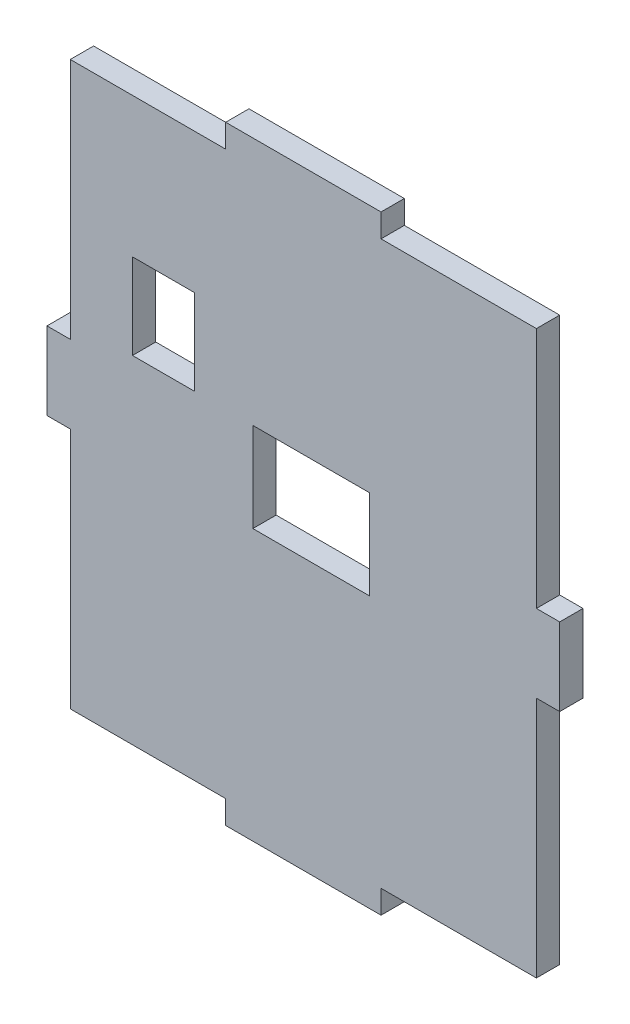
ISO-10303-21;
HEADER;
FILE_DESCRIPTION(('STEP AP214'),'2;1');
FILE_NAME('part.step','',(''),(''),'','','');
FILE_SCHEMA(('AUTOMOTIVE_DESIGN { 1 0 10303 214 1 1 1 1 }'));
ENDSEC;
DATA;
#1=APPLICATION_CONTEXT('core data for automotive mechanical design processes');
#2=APPLICATION_PROTOCOL_DEFINITION('international standard','automotive_design',2000,#1);
#3=PRODUCT_CONTEXT('',#1,'mechanical');
#4=PRODUCT('Part','Part','',(#3));
#5=PRODUCT_RELATED_PRODUCT_CATEGORY('part','',(#4));
#6=PRODUCT_DEFINITION_FORMATION('','',#4);
#7=PRODUCT_DEFINITION_CONTEXT('part definition',#1,'design');
#8=PRODUCT_DEFINITION('design','',#6,#7);
#9=PRODUCT_DEFINITION_SHAPE('','',#8);
#10=(LENGTH_UNIT() NAMED_UNIT(*) SI_UNIT(.MILLI.,.METRE.));
#11=(NAMED_UNIT(*) PLANE_ANGLE_UNIT() SI_UNIT($,.RADIAN.));
#12=(NAMED_UNIT(*) SI_UNIT($,.STERADIAN.) SOLID_ANGLE_UNIT());
#13=UNCERTAINTY_MEASURE_WITH_UNIT(LENGTH_MEASURE(1.E-05),#10,'distance_accuracy_value','');
#14=(GEOMETRIC_REPRESENTATION_CONTEXT(3) GLOBAL_UNCERTAINTY_ASSIGNED_CONTEXT((#13)) GLOBAL_UNIT_ASSIGNED_CONTEXT((#10,
#11,#12)) REPRESENTATION_CONTEXT('',''));
#15=CARTESIAN_POINT('',(0.,0.,0.));
#16=DIRECTION('',(0.,0.,1.));
#17=DIRECTION('',(1.,0.,0.));
#18=AXIS2_PLACEMENT_3D('',#15,#16,#17);
#19=CARTESIAN_POINT('',(0.,0.,3.));
#20=DIRECTION('',(0.,0.,1.));
#21=DIRECTION('',(1.,0.,0.));
#22=AXIS2_PLACEMENT_3D('',#19,#20,#21);
#23=PLANE('',#22);
#24=DIRECTION('',(-1.,0.,0.));
#25=VECTOR('',#24,1.);
#26=CARTESIAN_POINT('',(-47.6817994759,-34.0455415681,3.));
#27=LINE('',#26,#25);
#28=CARTESIAN_POINT('',(-47.6817994759,-34.0455415681,3.));
#29=VERTEX_POINT('',#28);
#30=CARTESIAN_POINT('',(-62.6817994759,-34.0455415681,3.));
#31=VERTEX_POINT('',#30);
#32=EDGE_CURVE('E399',#29,#31,#27,.T.);
#33=ORIENTED_EDGE('',*,*,#32,.F.);
#34=DIRECTION('',(0.,1.,0.));
#35=VECTOR('',#34,1.);
#36=CARTESIAN_POINT('',(-47.6817994759,-45.5455415681,3.));
#37=LINE('',#36,#35);
#38=CARTESIAN_POINT('',(-47.6817994759,-45.5455415681,3.));
#39=VERTEX_POINT('',#38);
#40=EDGE_CURVE('E397',#39,#29,#37,.T.);
#41=ORIENTED_EDGE('',*,*,#40,.F.);
#42=DIRECTION('',(1.,0.,0.));
#43=VECTOR('',#42,1.);
#44=CARTESIAN_POINT('',(-62.6817994759,-45.5455415681,3.));
#45=LINE('',#44,#43);
#46=CARTESIAN_POINT('',(-62.6817994759,-45.5455415681,3.));
#47=VERTEX_POINT('',#46);
#48=EDGE_CURVE('E405',#47,#39,#45,.T.);
#49=ORIENTED_EDGE('',*,*,#48,.F.);
#50=DIRECTION('',(0.,-1.,0.));
#51=VECTOR('',#50,1.);
#52=CARTESIAN_POINT('',(-62.6817994759,-34.0455415681,3.));
#53=LINE('',#52,#51);
#54=EDGE_CURVE('E402',#31,#47,#53,.T.);
#55=ORIENTED_EDGE('',*,*,#54,.F.);
#56=EDGE_LOOP('',(#33,#41,#49,#55));
#57=FACE_BOUND('',#56,.T.);
#58=DIRECTION('',(-1.,0.,0.));
#59=VECTOR('',#58,1.);
#60=CARTESIAN_POINT('',(-66.1817994759,-5.,3.));
#61=LINE('',#60,#59);
#62=CARTESIAN_POINT('',(-66.1817994759,-5.,3.));
#63=VERTEX_POINT('',#62);
#64=CARTESIAN_POINT('',(-86.1817994759,-5.,3.));
#65=VERTEX_POINT('',#64);
#66=EDGE_CURVE('E428',#63,#65,#61,.T.);
#67=ORIENTED_EDGE('',*,*,#66,.T.);
#68=DIRECTION('',(0.,-1.,0.));
#69=VECTOR('',#68,1.);
#70=CARTESIAN_POINT('',(-86.1817994759,-5.,3.));
#71=LINE('',#70,#69);
#72=CARTESIAN_POINT('',(-86.1817994759,-36.2,3.));
#73=VERTEX_POINT('',#72);
#74=EDGE_CURVE('E431',#65,#73,#71,.T.);
#75=ORIENTED_EDGE('',*,*,#74,.T.);
#76=DIRECTION('',(-1.,0.,0.));
#77=VECTOR('',#76,1.);
#78=CARTESIAN_POINT('',(-86.1817994759,-36.2,3.));
#79=LINE('',#78,#77);
#80=CARTESIAN_POINT('',(-89.1817994759,-36.2,3.));
#81=VERTEX_POINT('',#80);
#82=EDGE_CURVE('E434',#73,#81,#79,.T.);
#83=ORIENTED_EDGE('',*,*,#82,.T.);
#84=DIRECTION('',(0.,-1.,0.));
#85=VECTOR('',#84,1.);
#86=CARTESIAN_POINT('',(-89.1817994759,-36.2,3.));
#87=LINE('',#86,#85);
#88=CARTESIAN_POINT('',(-89.1817994759,-46.2,3.));
#89=VERTEX_POINT('',#88);
#90=EDGE_CURVE('E436',#81,#89,#87,.T.);
#91=ORIENTED_EDGE('',*,*,#90,.T.);
#92=DIRECTION('',(1.,0.,0.));
#93=VECTOR('',#92,1.);
#94=CARTESIAN_POINT('',(-89.1817994759,-46.2,3.));
#95=LINE('',#94,#93);
#96=CARTESIAN_POINT('',(-86.1817994759,-46.2,3.));
#97=VERTEX_POINT('',#96);
#98=EDGE_CURVE('E438',#89,#97,#95,.T.);
#99=ORIENTED_EDGE('',*,*,#98,.T.);
#100=DIRECTION('',(0.,-1.,0.));
#101=VECTOR('',#100,1.);
#102=CARTESIAN_POINT('',(-86.1817994759,-46.2,3.));
#103=LINE('',#102,#101);
#104=CARTESIAN_POINT('',(-86.1817994759,-77.4000000000001,3.));
#105=VERTEX_POINT('',#104);
#106=EDGE_CURVE('E440',#97,#105,#103,.T.);
#107=ORIENTED_EDGE('',*,*,#106,.T.);
#108=DIRECTION('',(1.,0.,0.));
#109=VECTOR('',#108,1.);
#110=CARTESIAN_POINT('',(-86.1817994759,-77.4000000000001,3.));
#111=LINE('',#110,#109);
#112=CARTESIAN_POINT('',(-66.1817994759,-77.4000000000001,3.));
#113=VERTEX_POINT('',#112);
#114=EDGE_CURVE('E442',#105,#113,#111,.T.);
#115=ORIENTED_EDGE('',*,*,#114,.T.);
#116=DIRECTION('',(0.,-1.,0.));
#117=VECTOR('',#116,1.);
#118=CARTESIAN_POINT('',(-66.1817994759,-77.4000000000001,3.));
#119=LINE('',#118,#117);
#120=CARTESIAN_POINT('',(-66.1817994759,-80.4,3.));
#121=VERTEX_POINT('',#120);
#122=EDGE_CURVE('E444',#113,#121,#119,.T.);
#123=ORIENTED_EDGE('',*,*,#122,.T.);
#124=DIRECTION('',(1.,0.,0.));
#125=VECTOR('',#124,1.);
#126=CARTESIAN_POINT('',(-66.1817994759,-80.4,3.));
#127=LINE('',#126,#125);
#128=CARTESIAN_POINT('',(-46.1817994759,-80.4,3.));
#129=VERTEX_POINT('',#128);
#130=EDGE_CURVE('E446',#121,#129,#127,.T.);
#131=ORIENTED_EDGE('',*,*,#130,.T.);
#132=DIRECTION('',(0.,1.,0.));
#133=VECTOR('',#132,1.);
#134=CARTESIAN_POINT('',(-46.1817994759,-80.4,3.));
#135=LINE('',#134,#133);
#136=CARTESIAN_POINT('',(-46.1817994759,-77.4,3.));
#137=VERTEX_POINT('',#136);
#138=EDGE_CURVE('E448',#129,#137,#135,.T.);
#139=ORIENTED_EDGE('',*,*,#138,.T.);
#140=DIRECTION('',(1.,0.,0.));
#141=VECTOR('',#140,1.);
#142=CARTESIAN_POINT('',(-46.1817994759,-77.4,3.));
#143=LINE('',#142,#141);
#144=CARTESIAN_POINT('',(-26.1817994759,-77.4,3.));
#145=VERTEX_POINT('',#144);
#146=EDGE_CURVE('E450',#137,#145,#143,.T.);
#147=ORIENTED_EDGE('',*,*,#146,.T.);
#148=DIRECTION('',(0.,1.,0.));
#149=VECTOR('',#148,1.);
#150=CARTESIAN_POINT('',(-26.1817994759,-77.4,3.));
#151=LINE('',#150,#149);
#152=CARTESIAN_POINT('',(-26.1817994759,-46.2,3.));
#153=VERTEX_POINT('',#152);
#154=EDGE_CURVE('E452',#145,#153,#151,.T.);
#155=ORIENTED_EDGE('',*,*,#154,.T.);
#156=DIRECTION('',(1.,0.,0.));
#157=VECTOR('',#156,1.);
#158=CARTESIAN_POINT('',(-26.1817994759,-46.2,3.));
#159=LINE('',#158,#157);
#160=CARTESIAN_POINT('',(-23.1817994759,-46.2,3.));
#161=VERTEX_POINT('',#160);
#162=EDGE_CURVE('E454',#153,#161,#159,.T.);
#163=ORIENTED_EDGE('',*,*,#162,.T.);
#164=DIRECTION('',(0.,1.,0.));
#165=VECTOR('',#164,1.);
#166=CARTESIAN_POINT('',(-23.1817994759,-46.2,3.));
#167=LINE('',#166,#165);
#168=CARTESIAN_POINT('',(-23.1817994759,-36.2,3.));
#169=VERTEX_POINT('',#168);
#170=EDGE_CURVE('E456',#161,#169,#167,.T.);
#171=ORIENTED_EDGE('',*,*,#170,.T.);
#172=DIRECTION('',(-1.,0.,0.));
#173=VECTOR('',#172,1.);
#174=CARTESIAN_POINT('',(-23.1817994759,-36.2,3.));
#175=LINE('',#174,#173);
#176=CARTESIAN_POINT('',(-26.1817994759,-36.2,3.));
#177=VERTEX_POINT('',#176);
#178=EDGE_CURVE('E458',#169,#177,#175,.T.);
#179=ORIENTED_EDGE('',*,*,#178,.T.);
#180=DIRECTION('',(0.,1.,0.));
#181=VECTOR('',#180,1.);
#182=CARTESIAN_POINT('',(-26.1817994759,-36.2,3.));
#183=LINE('',#182,#181);
#184=CARTESIAN_POINT('',(-26.1817994759,-5.,3.));
#185=VERTEX_POINT('',#184);
#186=EDGE_CURVE('E460',#177,#185,#183,.T.);
#187=ORIENTED_EDGE('',*,*,#186,.T.);
#188=DIRECTION('',(-1.,0.,0.));
#189=VECTOR('',#188,1.);
#190=CARTESIAN_POINT('',(-26.1817994759,-5.,3.));
#191=LINE('',#190,#189);
#192=CARTESIAN_POINT('',(-46.1817994759,-5.,3.));
#193=VERTEX_POINT('',#192);
#194=EDGE_CURVE('E462',#185,#193,#191,.T.);
#195=ORIENTED_EDGE('',*,*,#194,.T.);
#196=DIRECTION('',(0.,1.,0.));
#197=VECTOR('',#196,1.);
#198=CARTESIAN_POINT('',(-46.1817994759,-5.,3.));
#199=LINE('',#198,#197);
#200=CARTESIAN_POINT('',(-46.1817994759,-2.,3.));
#201=VERTEX_POINT('',#200);
#202=EDGE_CURVE('E464',#193,#201,#199,.T.);
#203=ORIENTED_EDGE('',*,*,#202,.T.);
#204=DIRECTION('',(-1.,0.,0.));
#205=VECTOR('',#204,1.);
#206=CARTESIAN_POINT('',(-46.1817994759,-2.,3.));
#207=LINE('',#206,#205);
#208=CARTESIAN_POINT('',(-66.1817994759,-2.,3.));
#209=VERTEX_POINT('',#208);
#210=EDGE_CURVE('E466',#201,#209,#207,.T.);
#211=ORIENTED_EDGE('',*,*,#210,.T.);
#212=DIRECTION('',(0.,-1.,0.));
#213=VECTOR('',#212,1.);
#214=CARTESIAN_POINT('',(-66.1817994759,-2.,3.));
#215=LINE('',#214,#213);
#216=EDGE_CURVE('E468',#209,#63,#215,.T.);
#217=ORIENTED_EDGE('',*,*,#216,.T.);
#218=EDGE_LOOP('',(#67,#75,#83,#91,#99,#107,#115,#123,#131,#139,#147,#155,#163,#171,#179,#187,
#195,#203,#211,#217));
#219=FACE_BOUND('',#218,.T.);
#220=DIRECTION('',(-1.,0.,0.));
#221=VECTOR('',#220,1.);
#222=CARTESIAN_POINT('',(-70.1817994759,-23.,3.));
#223=LINE('',#222,#221);
#224=CARTESIAN_POINT('',(-70.1817994759,-23.,3.));
#225=VERTEX_POINT('',#224);
#226=CARTESIAN_POINT('',(-78.1817994759,-23.,3.));
#227=VERTEX_POINT('',#226);
#228=EDGE_CURVE('E369',#225,#227,#223,.T.);
#229=ORIENTED_EDGE('',*,*,#228,.F.);
#230=DIRECTION('',(0.,1.,0.));
#231=VECTOR('',#230,1.);
#232=CARTESIAN_POINT('',(-70.1817994759,-34.,3.));
#233=LINE('',#232,#231);
#234=CARTESIAN_POINT('',(-70.1817994759,-34.,3.));
#235=VERTEX_POINT('',#234);
#236=EDGE_CURVE('E361',#235,#225,#233,.T.);
#237=ORIENTED_EDGE('',*,*,#236,.F.);
#238=DIRECTION('',(1.,0.,0.));
#239=VECTOR('',#238,1.);
#240=CARTESIAN_POINT('',(-78.1817994759,-34.,3.));
#241=LINE('',#240,#239);
#242=CARTESIAN_POINT('',(-78.1817994759,-34.,3.));
#243=VERTEX_POINT('',#242);
#244=EDGE_CURVE('E383',#243,#235,#241,.T.);
#245=ORIENTED_EDGE('',*,*,#244,.F.);
#246=DIRECTION('',(0.,-1.,0.));
#247=VECTOR('',#246,1.);
#248=CARTESIAN_POINT('',(-78.1817994759,-23.,3.));
#249=LINE('',#248,#247);
#250=EDGE_CURVE('E381',#227,#243,#249,.T.);
#251=ORIENTED_EDGE('',*,*,#250,.F.);
#252=EDGE_LOOP('',(#229,#237,#245,#251));
#253=FACE_BOUND('',#252,.T.);
#254=ADVANCED_FACE('F176',(#57,#219,#253),#23,.T.);
#255=CARTESIAN_POINT('',(0.,0.,0.));
#256=DIRECTION('',(0.,0.,1.));
#257=DIRECTION('',(1.,0.,0.));
#258=AXIS2_PLACEMENT_3D('',#255,#256,#257);
#259=PLANE('',#258);
#260=DIRECTION('',(0.,1.,0.));
#261=VECTOR('',#260,1.);
#262=CARTESIAN_POINT('',(-47.6817994759,-45.5455415681,0.));
#263=LINE('',#262,#261);
#264=CARTESIAN_POINT('',(-47.6817994759,-45.5455415681,0.));
#265=VERTEX_POINT('',#264);
#266=CARTESIAN_POINT('',(-47.6817994759,-34.0455415681,0.));
#267=VERTEX_POINT('',#266);
#268=EDGE_CURVE('E377',#265,#267,#263,.T.);
#269=ORIENTED_EDGE('',*,*,#268,.T.);
#270=DIRECTION('',(-1.,0.,0.));
#271=VECTOR('',#270,1.);
#272=CARTESIAN_POINT('',(-47.6817994759,-34.0455415681,0.));
#273=LINE('',#272,#271);
#274=CARTESIAN_POINT('',(-62.6817994759,-34.0455415681,0.));
#275=VERTEX_POINT('',#274);
#276=EDGE_CURVE('E410',#267,#275,#273,.T.);
#277=ORIENTED_EDGE('',*,*,#276,.T.);
#278=DIRECTION('',(0.,-1.,0.));
#279=VECTOR('',#278,1.);
#280=CARTESIAN_POINT('',(-62.6817994759,-34.0455415681,0.));
#281=LINE('',#280,#279);
#282=CARTESIAN_POINT('',(-62.6817994759,-45.5455415681,0.));
#283=VERTEX_POINT('',#282);
#284=EDGE_CURVE('E413',#275,#283,#281,.T.);
#285=ORIENTED_EDGE('',*,*,#284,.T.);
#286=DIRECTION('',(1.,0.,0.));
#287=VECTOR('',#286,1.);
#288=CARTESIAN_POINT('',(-62.6817994759,-45.5455415681,0.));
#289=LINE('',#288,#287);
#290=EDGE_CURVE('E400',#283,#265,#289,.T.);
#291=ORIENTED_EDGE('',*,*,#290,.T.);
#292=EDGE_LOOP('',(#269,#277,#285,#291));
#293=FACE_BOUND('',#292,.T.);
#294=DIRECTION('',(-1.,0.,0.));
#295=VECTOR('',#294,1.);
#296=CARTESIAN_POINT('',(-66.1817994759,-5.,0.));
#297=LINE('',#296,#295);
#298=CARTESIAN_POINT('',(-66.1817994759,-5.,0.));
#299=VERTEX_POINT('',#298);
#300=CARTESIAN_POINT('',(-86.1817994759,-5.,0.));
#301=VERTEX_POINT('',#300);
#302=EDGE_CURVE('E427',#299,#301,#297,.T.);
#303=ORIENTED_EDGE('',*,*,#302,.F.);
#304=DIRECTION('',(0.,-1.,0.));
#305=VECTOR('',#304,1.);
#306=CARTESIAN_POINT('',(-66.1817994759,-2.,0.));
#307=LINE('',#306,#305);
#308=CARTESIAN_POINT('',(-66.1817994759,-2.,0.));
#309=VERTEX_POINT('',#308);
#310=EDGE_CURVE('E432',#309,#299,#307,.T.);
#311=ORIENTED_EDGE('',*,*,#310,.F.);
#312=DIRECTION('',(-1.,0.,0.));
#313=VECTOR('',#312,1.);
#314=CARTESIAN_POINT('',(-46.1817994759,-2.,0.));
#315=LINE('',#314,#313);
#316=CARTESIAN_POINT('',(-46.1817994759,-2.,0.));
#317=VERTEX_POINT('',#316);
#318=EDGE_CURVE('E507',#317,#309,#315,.T.);
#319=ORIENTED_EDGE('',*,*,#318,.F.);
#320=DIRECTION('',(0.,1.,0.));
#321=VECTOR('',#320,1.);
#322=CARTESIAN_POINT('',(-46.1817994759,-5.,0.));
#323=LINE('',#322,#321);
#324=CARTESIAN_POINT('',(-46.1817994759,-5.,0.));
#325=VERTEX_POINT('',#324);
#326=EDGE_CURVE('E505',#325,#317,#323,.T.);
#327=ORIENTED_EDGE('',*,*,#326,.F.);
#328=DIRECTION('',(-1.,0.,0.));
#329=VECTOR('',#328,1.);
#330=CARTESIAN_POINT('',(-26.1817994759,-5.,0.));
#331=LINE('',#330,#329);
#332=CARTESIAN_POINT('',(-26.1817994759,-5.,0.));
#333=VERTEX_POINT('',#332);
#334=EDGE_CURVE('E503',#333,#325,#331,.T.);
#335=ORIENTED_EDGE('',*,*,#334,.F.);
#336=DIRECTION('',(0.,1.,0.));
#337=VECTOR('',#336,1.);
#338=CARTESIAN_POINT('',(-26.1817994759,-36.2,0.));
#339=LINE('',#338,#337);
#340=CARTESIAN_POINT('',(-26.1817994759,-36.2,0.));
#341=VERTEX_POINT('',#340);
#342=EDGE_CURVE('E501',#341,#333,#339,.T.);
#343=ORIENTED_EDGE('',*,*,#342,.F.);
#344=DIRECTION('',(-1.,0.,0.));
#345=VECTOR('',#344,1.);
#346=CARTESIAN_POINT('',(-23.1817994759,-36.2,0.));
#347=LINE('',#346,#345);
#348=CARTESIAN_POINT('',(-23.1817994759,-36.2,0.));
#349=VERTEX_POINT('',#348);
#350=EDGE_CURVE('E499',#349,#341,#347,.T.);
#351=ORIENTED_EDGE('',*,*,#350,.F.);
#352=DIRECTION('',(0.,1.,0.));
#353=VECTOR('',#352,1.);
#354=CARTESIAN_POINT('',(-23.1817994759,-46.2,0.));
#355=LINE('',#354,#353);
#356=CARTESIAN_POINT('',(-23.1817994759,-46.2,0.));
#357=VERTEX_POINT('',#356);
#358=EDGE_CURVE('E497',#357,#349,#355,.T.);
#359=ORIENTED_EDGE('',*,*,#358,.F.);
#360=DIRECTION('',(1.,0.,0.));
#361=VECTOR('',#360,1.);
#362=CARTESIAN_POINT('',(-26.1817994759,-46.2,0.));
#363=LINE('',#362,#361);
#364=CARTESIAN_POINT('',(-26.1817994759,-46.2,0.));
#365=VERTEX_POINT('',#364);
#366=EDGE_CURVE('E495',#365,#357,#363,.T.);
#367=ORIENTED_EDGE('',*,*,#366,.F.);
#368=DIRECTION('',(0.,1.,0.));
#369=VECTOR('',#368,1.);
#370=CARTESIAN_POINT('',(-26.1817994759,-77.4,0.));
#371=LINE('',#370,#369);
#372=CARTESIAN_POINT('',(-26.1817994759,-77.4,0.));
#373=VERTEX_POINT('',#372);
#374=EDGE_CURVE('E493',#373,#365,#371,.T.);
#375=ORIENTED_EDGE('',*,*,#374,.F.);
#376=DIRECTION('',(1.,0.,0.));
#377=VECTOR('',#376,1.);
#378=CARTESIAN_POINT('',(-46.1817994759,-77.4,0.));
#379=LINE('',#378,#377);
#380=CARTESIAN_POINT('',(-46.1817994759,-77.4,0.));
#381=VERTEX_POINT('',#380);
#382=EDGE_CURVE('E491',#381,#373,#379,.T.);
#383=ORIENTED_EDGE('',*,*,#382,.F.);
#384=DIRECTION('',(0.,1.,0.));
#385=VECTOR('',#384,1.);
#386=CARTESIAN_POINT('',(-46.1817994759,-80.4,0.));
#387=LINE('',#386,#385);
#388=CARTESIAN_POINT('',(-46.1817994759,-80.4,0.));
#389=VERTEX_POINT('',#388);
#390=EDGE_CURVE('E489',#389,#381,#387,.T.);
#391=ORIENTED_EDGE('',*,*,#390,.F.);
#392=DIRECTION('',(1.,0.,0.));
#393=VECTOR('',#392,1.);
#394=CARTESIAN_POINT('',(-66.1817994759,-80.4,0.));
#395=LINE('',#394,#393);
#396=CARTESIAN_POINT('',(-66.1817994759,-80.4,0.));
#397=VERTEX_POINT('',#396);
#398=EDGE_CURVE('E487',#397,#389,#395,.T.);
#399=ORIENTED_EDGE('',*,*,#398,.F.);
#400=DIRECTION('',(0.,-1.,0.));
#401=VECTOR('',#400,1.);
#402=CARTESIAN_POINT('',(-66.1817994759,-77.4000000000001,0.));
#403=LINE('',#402,#401);
#404=CARTESIAN_POINT('',(-66.1817994759,-77.4000000000001,0.));
#405=VERTEX_POINT('',#404);
#406=EDGE_CURVE('E485',#405,#397,#403,.T.);
#407=ORIENTED_EDGE('',*,*,#406,.F.);
#408=DIRECTION('',(1.,0.,0.));
#409=VECTOR('',#408,1.);
#410=CARTESIAN_POINT('',(-86.1817994759,-77.4000000000001,0.));
#411=LINE('',#410,#409);
#412=CARTESIAN_POINT('',(-86.1817994759,-77.4000000000001,0.));
#413=VERTEX_POINT('',#412);
#414=EDGE_CURVE('E483',#413,#405,#411,.T.);
#415=ORIENTED_EDGE('',*,*,#414,.F.);
#416=DIRECTION('',(0.,-1.,0.));
#417=VECTOR('',#416,1.);
#418=CARTESIAN_POINT('',(-86.1817994759,-46.2,0.));
#419=LINE('',#418,#417);
#420=CARTESIAN_POINT('',(-86.1817994759,-46.2,0.));
#421=VERTEX_POINT('',#420);
#422=EDGE_CURVE('E481',#421,#413,#419,.T.);
#423=ORIENTED_EDGE('',*,*,#422,.F.);
#424=DIRECTION('',(1.,0.,0.));
#425=VECTOR('',#424,1.);
#426=CARTESIAN_POINT('',(-89.1817994759,-46.2,0.));
#427=LINE('',#426,#425);
#428=CARTESIAN_POINT('',(-89.1817994759,-46.2,0.));
#429=VERTEX_POINT('',#428);
#430=EDGE_CURVE('E479',#429,#421,#427,.T.);
#431=ORIENTED_EDGE('',*,*,#430,.F.);
#432=DIRECTION('',(0.,-1.,0.));
#433=VECTOR('',#432,1.);
#434=CARTESIAN_POINT('',(-89.1817994759,-36.2,0.));
#435=LINE('',#434,#433);
#436=CARTESIAN_POINT('',(-89.1817994759,-36.2,0.));
#437=VERTEX_POINT('',#436);
#438=EDGE_CURVE('E477',#437,#429,#435,.T.);
#439=ORIENTED_EDGE('',*,*,#438,.F.);
#440=DIRECTION('',(-1.,0.,0.));
#441=VECTOR('',#440,1.);
#442=CARTESIAN_POINT('',(-86.1817994759,-36.2,0.));
#443=LINE('',#442,#441);
#444=CARTESIAN_POINT('',(-86.1817994759,-36.2,0.));
#445=VERTEX_POINT('',#444);
#446=EDGE_CURVE('E475',#445,#437,#443,.T.);
#447=ORIENTED_EDGE('',*,*,#446,.F.);
#448=DIRECTION('',(0.,-1.,0.));
#449=VECTOR('',#448,1.);
#450=CARTESIAN_POINT('',(-86.1817994759,-5.,0.));
#451=LINE('',#450,#449);
#452=EDGE_CURVE('E473',#301,#445,#451,.T.);
#453=ORIENTED_EDGE('',*,*,#452,.F.);
#454=EDGE_LOOP('',(#303,#311,#319,#327,#335,#343,#351,#359,#367,#375,#383,#391,#399,#407,#415,
#423,#431,#439,#447,#453));
#455=FACE_BOUND('',#454,.T.);
#456=DIRECTION('',(0.,1.,0.));
#457=VECTOR('',#456,1.);
#458=CARTESIAN_POINT('',(-70.1817994759,-34.,0.));
#459=LINE('',#458,#457);
#460=CARTESIAN_POINT('',(-70.1817994759,-34.,0.));
#461=VERTEX_POINT('',#460);
#462=CARTESIAN_POINT('',(-70.1817994759,-23.,0.));
#463=VERTEX_POINT('',#462);
#464=EDGE_CURVE('E199',#461,#463,#459,.T.);
#465=ORIENTED_EDGE('',*,*,#464,.T.);
#466=DIRECTION('',(-1.,0.,0.));
#467=VECTOR('',#466,1.);
#468=CARTESIAN_POINT('',(-70.1817994759,-23.,0.));
#469=LINE('',#468,#467);
#470=CARTESIAN_POINT('',(-78.1817994759,-23.,0.));
#471=VERTEX_POINT('',#470);
#472=EDGE_CURVE('E376',#463,#471,#469,.T.);
#473=ORIENTED_EDGE('',*,*,#472,.T.);
#474=DIRECTION('',(0.,-1.,0.));
#475=VECTOR('',#474,1.);
#476=CARTESIAN_POINT('',(-78.1817994759,-23.,0.));
#477=LINE('',#476,#475);
#478=CARTESIAN_POINT('',(-78.1817994759,-34.,0.));
#479=VERTEX_POINT('',#478);
#480=EDGE_CURVE('E389',#471,#479,#477,.T.);
#481=ORIENTED_EDGE('',*,*,#480,.T.);
#482=DIRECTION('',(1.,0.,0.));
#483=VECTOR('',#482,1.);
#484=CARTESIAN_POINT('',(-78.1817994759,-34.,0.));
#485=LINE('',#484,#483);
#486=EDGE_CURVE('E370',#479,#461,#485,.T.);
#487=ORIENTED_EDGE('',*,*,#486,.T.);
#488=EDGE_LOOP('',(#465,#473,#481,#487));
#489=FACE_BOUND('',#488,.T.);
#490=ADVANCED_FACE('F573',(#293,#455,#489),#259,.F.);
#491=CARTESIAN_POINT('',(-66.1817994759,-5.,3.));
#492=DIRECTION('',(0.,-1.,0.));
#493=DIRECTION('',(0.,0.,-1.));
#494=AXIS2_PLACEMENT_3D('',#491,#492,#493);
#495=PLANE('',#494);
#496=ORIENTED_EDGE('',*,*,#302,.T.);
#497=DIRECTION('',(0.,0.,-1.));
#498=VECTOR('',#497,1.);
#499=CARTESIAN_POINT('',(-86.1817994759,-5.,3.));
#500=LINE('',#499,#498);
#501=EDGE_CURVE('E12',#65,#301,#500,.T.);
#502=ORIENTED_EDGE('',*,*,#501,.F.);
#503=ORIENTED_EDGE('',*,*,#66,.F.);
#504=DIRECTION('',(0.,0.,-1.));
#505=VECTOR('',#504,1.);
#506=CARTESIAN_POINT('',(-66.1817994759,-5.,3.));
#507=LINE('',#506,#505);
#508=EDGE_CURVE('E470',#63,#299,#507,.T.);
#509=ORIENTED_EDGE('',*,*,#508,.T.);
#510=EDGE_LOOP('',(#496,#502,#503,#509));
#511=FACE_BOUND('',#510,.T.);
#512=ADVANCED_FACE('F178',(#511),#495,.F.);
#513=CARTESIAN_POINT('',(-86.1817994759,-5.,3.));
#514=DIRECTION('',(1.,0.,0.));
#515=DIRECTION('',(0.,0.,-1.));
#516=AXIS2_PLACEMENT_3D('',#513,#514,#515);
#517=PLANE('',#516);
#518=ORIENTED_EDGE('',*,*,#452,.T.);
#519=DIRECTION('',(0.,0.,-1.));
#520=VECTOR('',#519,1.);
#521=CARTESIAN_POINT('',(-86.1817994759,-36.2,3.));
#522=LINE('',#521,#520);
#523=EDGE_CURVE('E184',#73,#445,#522,.T.);
#524=ORIENTED_EDGE('',*,*,#523,.F.);
#525=ORIENTED_EDGE('',*,*,#74,.F.);
#526=ORIENTED_EDGE('',*,*,#501,.T.);
#527=EDGE_LOOP('',(#518,#524,#525,#526));
#528=FACE_BOUND('',#527,.T.);
#529=ADVANCED_FACE('F590',(#528),#517,.F.);
#530=CARTESIAN_POINT('',(-86.1817994759,-36.2,3.));
#531=DIRECTION('',(0.,-1.,0.));
#532=DIRECTION('',(0.,0.,-1.));
#533=AXIS2_PLACEMENT_3D('',#530,#531,#532);
#534=PLANE('',#533);
#535=ORIENTED_EDGE('',*,*,#446,.T.);
#536=DIRECTION('',(0.,0.,-1.));
#537=VECTOR('',#536,1.);
#538=CARTESIAN_POINT('',(-89.1817994759,-36.2,3.));
#539=LINE('',#538,#537);
#540=EDGE_CURVE('E560',#81,#437,#539,.T.);
#541=ORIENTED_EDGE('',*,*,#540,.F.);
#542=ORIENTED_EDGE('',*,*,#82,.F.);
#543=ORIENTED_EDGE('',*,*,#523,.T.);
#544=EDGE_LOOP('',(#535,#541,#542,#543));
#545=FACE_BOUND('',#544,.T.);
#546=ADVANCED_FACE('F567',(#545),#534,.F.);
#547=CARTESIAN_POINT('',(-89.1817994759,-36.2,3.));
#548=DIRECTION('',(1.,0.,0.));
#549=DIRECTION('',(0.,0.,-1.));
#550=AXIS2_PLACEMENT_3D('',#547,#548,#549);
#551=PLANE('',#550);
#552=ORIENTED_EDGE('',*,*,#438,.T.);
#553=DIRECTION('',(0.,0.,-1.));
#554=VECTOR('',#553,1.);
#555=CARTESIAN_POINT('',(-89.1817994759,-46.2,3.));
#556=LINE('',#555,#554);
#557=EDGE_CURVE('E557',#89,#429,#556,.T.);
#558=ORIENTED_EDGE('',*,*,#557,.F.);
#559=ORIENTED_EDGE('',*,*,#90,.F.);
#560=ORIENTED_EDGE('',*,*,#540,.T.);
#561=EDGE_LOOP('',(#552,#558,#559,#560));
#562=FACE_BOUND('',#561,.T.);
#563=ADVANCED_FACE('F579',(#562),#551,.F.);
#564=CARTESIAN_POINT('',(-89.1817994759,-46.2,3.));
#565=DIRECTION('',(0.,1.,0.));
#566=DIRECTION('',(0.,0.,1.));
#567=AXIS2_PLACEMENT_3D('',#564,#565,#566);
#568=PLANE('',#567);
#569=ORIENTED_EDGE('',*,*,#430,.T.);
#570=DIRECTION('',(0.,0.,-1.));
#571=VECTOR('',#570,1.);
#572=CARTESIAN_POINT('',(-86.1817994759,-46.2,3.));
#573=LINE('',#572,#571);
#574=EDGE_CURVE('E554',#97,#421,#573,.T.);
#575=ORIENTED_EDGE('',*,*,#574,.F.);
#576=ORIENTED_EDGE('',*,*,#98,.F.);
#577=ORIENTED_EDGE('',*,*,#557,.T.);
#578=EDGE_LOOP('',(#569,#575,#576,#577));
#579=FACE_BOUND('',#578,.T.);
#580=ADVANCED_FACE('F583',(#579),#568,.F.);
#581=CARTESIAN_POINT('',(-86.1817994759,-46.2,3.));
#582=DIRECTION('',(1.,0.,0.));
#583=DIRECTION('',(0.,1.,0.));
#584=AXIS2_PLACEMENT_3D('',#581,#582,#583);
#585=PLANE('',#584);
#586=ORIENTED_EDGE('',*,*,#422,.T.);
#587=DIRECTION('',(0.,0.,-1.));
#588=VECTOR('',#587,1.);
#589=CARTESIAN_POINT('',(-86.1817994759,-77.4000000000001,3.));
#590=LINE('',#589,#588);
#591=EDGE_CURVE('E551',#105,#413,#590,.T.);
#592=ORIENTED_EDGE('',*,*,#591,.F.);
#593=ORIENTED_EDGE('',*,*,#106,.F.);
#594=ORIENTED_EDGE('',*,*,#574,.T.);
#595=EDGE_LOOP('',(#586,#592,#593,#594));
#596=FACE_BOUND('',#595,.T.);
#597=ADVANCED_FACE('F663',(#596),#585,.F.);
#598=CARTESIAN_POINT('',(-86.1817994759,-77.4000000000001,3.));
#599=DIRECTION('',(0.,1.,0.));
#600=DIRECTION('',(-1.,0.,0.));
#601=AXIS2_PLACEMENT_3D('',#598,#599,#600);
#602=PLANE('',#601);
#603=ORIENTED_EDGE('',*,*,#414,.T.);
#604=DIRECTION('',(0.,0.,-1.));
#605=VECTOR('',#604,1.);
#606=CARTESIAN_POINT('',(-66.1817994759,-77.4000000000001,3.));
#607=LINE('',#606,#605);
#608=EDGE_CURVE('E548',#113,#405,#607,.T.);
#609=ORIENTED_EDGE('',*,*,#608,.F.);
#610=ORIENTED_EDGE('',*,*,#114,.F.);
#611=ORIENTED_EDGE('',*,*,#591,.T.);
#612=EDGE_LOOP('',(#603,#609,#610,#611));
#613=FACE_BOUND('',#612,.T.);
#614=ADVANCED_FACE('F661',(#613),#602,.F.);
#615=CARTESIAN_POINT('',(-66.1817994759,-77.4000000000001,3.));
#616=DIRECTION('',(1.,0.,0.));
#617=DIRECTION('',(0.,0.,-1.));
#618=AXIS2_PLACEMENT_3D('',#615,#616,#617);
#619=PLANE('',#618);
#620=ORIENTED_EDGE('',*,*,#406,.T.);
#621=DIRECTION('',(0.,0.,-1.));
#622=VECTOR('',#621,1.);
#623=CARTESIAN_POINT('',(-66.1817994759,-80.4,3.));
#624=LINE('',#623,#622);
#625=EDGE_CURVE('E545',#121,#397,#624,.T.);
#626=ORIENTED_EDGE('',*,*,#625,.F.);
#627=ORIENTED_EDGE('',*,*,#122,.F.);
#628=ORIENTED_EDGE('',*,*,#608,.T.);
#629=EDGE_LOOP('',(#620,#626,#627,#628));
#630=FACE_BOUND('',#629,.T.);
#631=ADVANCED_FACE('F656',(#630),#619,.F.);
#632=CARTESIAN_POINT('',(-66.1817994759,-80.4,3.));
#633=DIRECTION('',(0.,1.,0.));
#634=DIRECTION('',(0.,0.,1.));
#635=AXIS2_PLACEMENT_3D('',#632,#633,#634);
#636=PLANE('',#635);
#637=ORIENTED_EDGE('',*,*,#398,.T.);
#638=DIRECTION('',(0.,0.,-1.));
#639=VECTOR('',#638,1.);
#640=CARTESIAN_POINT('',(-46.1817994759,-80.4,3.));
#641=LINE('',#640,#639);
#642=EDGE_CURVE('E542',#129,#389,#641,.T.);
#643=ORIENTED_EDGE('',*,*,#642,.F.);
#644=ORIENTED_EDGE('',*,*,#130,.F.);
#645=ORIENTED_EDGE('',*,*,#625,.T.);
#646=EDGE_LOOP('',(#637,#643,#644,#645));
#647=FACE_BOUND('',#646,.T.);
#648=ADVANCED_FACE('F651',(#647),#636,.F.);
#649=CARTESIAN_POINT('',(-46.1817994759,-80.4,3.));
#650=DIRECTION('',(-1.,0.,0.));
#651=DIRECTION('',(0.,0.,1.));
#652=AXIS2_PLACEMENT_3D('',#649,#650,#651);
#653=PLANE('',#652);
#654=ORIENTED_EDGE('',*,*,#390,.T.);
#655=DIRECTION('',(0.,0.,-1.));
#656=VECTOR('',#655,1.);
#657=CARTESIAN_POINT('',(-46.1817994759,-77.4,3.));
#658=LINE('',#657,#656);
#659=EDGE_CURVE('E539',#137,#381,#658,.T.);
#660=ORIENTED_EDGE('',*,*,#659,.F.);
#661=ORIENTED_EDGE('',*,*,#138,.F.);
#662=ORIENTED_EDGE('',*,*,#642,.T.);
#663=EDGE_LOOP('',(#654,#660,#661,#662));
#664=FACE_BOUND('',#663,.T.);
#665=ADVANCED_FACE('F647',(#664),#653,.F.);
#666=CARTESIAN_POINT('',(-46.1817994759,-77.4,3.));
#667=DIRECTION('',(0.,1.,0.));
#668=DIRECTION('',(0.,0.,1.));
#669=AXIS2_PLACEMENT_3D('',#666,#667,#668);
#670=PLANE('',#669);
#671=ORIENTED_EDGE('',*,*,#382,.T.);
#672=DIRECTION('',(0.,0.,-1.));
#673=VECTOR('',#672,1.);
#674=CARTESIAN_POINT('',(-26.1817994759,-77.4,3.));
#675=LINE('',#674,#673);
#676=EDGE_CURVE('E536',#145,#373,#675,.T.);
#677=ORIENTED_EDGE('',*,*,#676,.F.);
#678=ORIENTED_EDGE('',*,*,#146,.F.);
#679=ORIENTED_EDGE('',*,*,#659,.T.);
#680=EDGE_LOOP('',(#671,#677,#678,#679));
#681=FACE_BOUND('',#680,.T.);
#682=ADVANCED_FACE('F642',(#681),#670,.F.);
#683=CARTESIAN_POINT('',(-26.1817994759,-77.4,3.));
#684=DIRECTION('',(-1.,0.,0.));
#685=DIRECTION('',(0.,-1.,0.));
#686=AXIS2_PLACEMENT_3D('',#683,#684,#685);
#687=PLANE('',#686);
#688=ORIENTED_EDGE('',*,*,#374,.T.);
#689=DIRECTION('',(0.,0.,-1.));
#690=VECTOR('',#689,1.);
#691=CARTESIAN_POINT('',(-26.1817994759,-46.2,3.));
#692=LINE('',#691,#690);
#693=EDGE_CURVE('E533',#153,#365,#692,.T.);
#694=ORIENTED_EDGE('',*,*,#693,.F.);
#695=ORIENTED_EDGE('',*,*,#154,.F.);
#696=ORIENTED_EDGE('',*,*,#676,.T.);
#697=EDGE_LOOP('',(#688,#694,#695,#696));
#698=FACE_BOUND('',#697,.T.);
#699=ADVANCED_FACE('F636',(#698),#687,.F.);
#700=CARTESIAN_POINT('',(-26.1817994759,-46.2,3.));
#701=DIRECTION('',(0.,1.,0.));
#702=DIRECTION('',(0.,0.,1.));
#703=AXIS2_PLACEMENT_3D('',#700,#701,#702);
#704=PLANE('',#703);
#705=ORIENTED_EDGE('',*,*,#366,.T.);
#706=DIRECTION('',(0.,0.,-1.));
#707=VECTOR('',#706,1.);
#708=CARTESIAN_POINT('',(-23.1817994759,-46.2,3.));
#709=LINE('',#708,#707);
#710=EDGE_CURVE('E530',#161,#357,#709,.T.);
#711=ORIENTED_EDGE('',*,*,#710,.F.);
#712=ORIENTED_EDGE('',*,*,#162,.F.);
#713=ORIENTED_EDGE('',*,*,#693,.T.);
#714=EDGE_LOOP('',(#705,#711,#712,#713));
#715=FACE_BOUND('',#714,.T.);
#716=ADVANCED_FACE('F632',(#715),#704,.F.);
#717=CARTESIAN_POINT('',(-23.1817994759,-46.2,3.));
#718=DIRECTION('',(-1.,0.,0.));
#719=DIRECTION('',(0.,0.,1.));
#720=AXIS2_PLACEMENT_3D('',#717,#718,#719);
#721=PLANE('',#720);
#722=ORIENTED_EDGE('',*,*,#358,.T.);
#723=DIRECTION('',(0.,0.,-1.));
#724=VECTOR('',#723,1.);
#725=CARTESIAN_POINT('',(-23.1817994759,-36.2,3.));
#726=LINE('',#725,#724);
#727=EDGE_CURVE('E527',#169,#349,#726,.T.);
#728=ORIENTED_EDGE('',*,*,#727,.F.);
#729=ORIENTED_EDGE('',*,*,#170,.F.);
#730=ORIENTED_EDGE('',*,*,#710,.T.);
#731=EDGE_LOOP('',(#722,#728,#729,#730));
#732=FACE_BOUND('',#731,.T.);
#733=ADVANCED_FACE('F627',(#732),#721,.F.);
#734=CARTESIAN_POINT('',(-23.1817994759,-36.2,3.));
#735=DIRECTION('',(0.,-1.,0.));
#736=DIRECTION('',(0.,0.,-1.));
#737=AXIS2_PLACEMENT_3D('',#734,#735,#736);
#738=PLANE('',#737);
#739=ORIENTED_EDGE('',*,*,#350,.T.);
#740=DIRECTION('',(0.,0.,-1.));
#741=VECTOR('',#740,1.);
#742=CARTESIAN_POINT('',(-26.1817994759,-36.2,3.));
#743=LINE('',#742,#741);
#744=EDGE_CURVE('E524',#177,#341,#743,.T.);
#745=ORIENTED_EDGE('',*,*,#744,.F.);
#746=ORIENTED_EDGE('',*,*,#178,.F.);
#747=ORIENTED_EDGE('',*,*,#727,.T.);
#748=EDGE_LOOP('',(#739,#745,#746,#747));
#749=FACE_BOUND('',#748,.T.);
#750=ADVANCED_FACE('F621',(#749),#738,.F.);
#751=CARTESIAN_POINT('',(-26.1817994759,-36.2,3.));
#752=DIRECTION('',(-1.,0.,0.));
#753=DIRECTION('',(0.,-1.,0.));
#754=AXIS2_PLACEMENT_3D('',#751,#752,#753);
#755=PLANE('',#754);
#756=ORIENTED_EDGE('',*,*,#342,.T.);
#757=DIRECTION('',(0.,0.,-1.));
#758=VECTOR('',#757,1.);
#759=CARTESIAN_POINT('',(-26.1817994759,-5.,3.));
#760=LINE('',#759,#758);
#761=EDGE_CURVE('E521',#185,#333,#760,.T.);
#762=ORIENTED_EDGE('',*,*,#761,.F.);
#763=ORIENTED_EDGE('',*,*,#186,.F.);
#764=ORIENTED_EDGE('',*,*,#744,.T.);
#765=EDGE_LOOP('',(#756,#762,#763,#764));
#766=FACE_BOUND('',#765,.T.);
#767=ADVANCED_FACE('F617',(#766),#755,.F.);
#768=CARTESIAN_POINT('',(-26.1817994759,-5.,3.));
#769=DIRECTION('',(0.,-1.,0.));
#770=DIRECTION('',(0.,0.,-1.));
#771=AXIS2_PLACEMENT_3D('',#768,#769,#770);
#772=PLANE('',#771);
#773=ORIENTED_EDGE('',*,*,#334,.T.);
#774=DIRECTION('',(0.,0.,-1.));
#775=VECTOR('',#774,1.);
#776=CARTESIAN_POINT('',(-46.1817994759,-5.,3.));
#777=LINE('',#776,#775);
#778=EDGE_CURVE('E518',#193,#325,#777,.T.);
#779=ORIENTED_EDGE('',*,*,#778,.F.);
#780=ORIENTED_EDGE('',*,*,#194,.F.);
#781=ORIENTED_EDGE('',*,*,#761,.T.);
#782=EDGE_LOOP('',(#773,#779,#780,#781));
#783=FACE_BOUND('',#782,.T.);
#784=ADVANCED_FACE('F612',(#783),#772,.F.);
#785=CARTESIAN_POINT('',(-46.1817994759,-5.,3.));
#786=DIRECTION('',(-1.,0.,0.));
#787=DIRECTION('',(0.,0.,1.));
#788=AXIS2_PLACEMENT_3D('',#785,#786,#787);
#789=PLANE('',#788);
#790=ORIENTED_EDGE('',*,*,#326,.T.);
#791=DIRECTION('',(0.,0.,-1.));
#792=VECTOR('',#791,1.);
#793=CARTESIAN_POINT('',(-46.1817994759,-2.,3.));
#794=LINE('',#793,#792);
#795=EDGE_CURVE('E515',#201,#317,#794,.T.);
#796=ORIENTED_EDGE('',*,*,#795,.F.);
#797=ORIENTED_EDGE('',*,*,#202,.F.);
#798=ORIENTED_EDGE('',*,*,#778,.T.);
#799=EDGE_LOOP('',(#790,#796,#797,#798));
#800=FACE_BOUND('',#799,.T.);
#801=ADVANCED_FACE('F606',(#800),#789,.F.);
#802=CARTESIAN_POINT('',(-46.1817994759,-2.,3.));
#803=DIRECTION('',(0.,-1.,0.));
#804=DIRECTION('',(0.,0.,-1.));
#805=AXIS2_PLACEMENT_3D('',#802,#803,#804);
#806=PLANE('',#805);
#807=ORIENTED_EDGE('',*,*,#318,.T.);
#808=DIRECTION('',(0.,0.,-1.));
#809=VECTOR('',#808,1.);
#810=CARTESIAN_POINT('',(-66.1817994759,-2.,3.));
#811=LINE('',#810,#809);
#812=EDGE_CURVE('E512',#209,#309,#811,.T.);
#813=ORIENTED_EDGE('',*,*,#812,.F.);
#814=ORIENTED_EDGE('',*,*,#210,.F.);
#815=ORIENTED_EDGE('',*,*,#795,.T.);
#816=EDGE_LOOP('',(#807,#813,#814,#815));
#817=FACE_BOUND('',#816,.T.);
#818=ADVANCED_FACE('F602',(#817),#806,.F.);
#819=CARTESIAN_POINT('',(-66.1817994759,-2.,3.));
#820=DIRECTION('',(1.,0.,0.));
#821=DIRECTION('',(0.,0.,-1.));
#822=AXIS2_PLACEMENT_3D('',#819,#820,#821);
#823=PLANE('',#822);
#824=ORIENTED_EDGE('',*,*,#310,.T.);
#825=ORIENTED_EDGE('',*,*,#508,.F.);
#826=ORIENTED_EDGE('',*,*,#216,.F.);
#827=ORIENTED_EDGE('',*,*,#812,.T.);
#828=EDGE_LOOP('',(#824,#825,#826,#827));
#829=FACE_BOUND('',#828,.T.);
#830=ADVANCED_FACE('F597',(#829),#823,.F.);
#831=CARTESIAN_POINT('',(-47.6817994759,-45.5455415681,3.));
#832=DIRECTION('',(-1.,0.,0.));
#833=DIRECTION('',(0.,-1.,0.));
#834=AXIS2_PLACEMENT_3D('',#831,#832,#833);
#835=PLANE('',#834);
#836=ORIENTED_EDGE('',*,*,#268,.F.);
#837=DIRECTION('',(0.,0.,-1.));
#838=VECTOR('',#837,1.);
#839=CARTESIAN_POINT('',(-47.6817994759,-45.5455415681,3.));
#840=LINE('',#839,#838);
#841=EDGE_CURVE('E407',#39,#265,#840,.T.);
#842=ORIENTED_EDGE('',*,*,#841,.F.);
#843=ORIENTED_EDGE('',*,*,#40,.T.);
#844=DIRECTION('',(0.,0.,-1.));
#845=VECTOR('',#844,1.);
#846=CARTESIAN_POINT('',(-47.6817994759,-34.0455415681,3.));
#847=LINE('',#846,#845);
#848=EDGE_CURVE('E424',#29,#267,#847,.T.);
#849=ORIENTED_EDGE('',*,*,#848,.T.);
#850=EDGE_LOOP('',(#836,#842,#843,#849));
#851=FACE_BOUND('',#850,.T.);
#852=ADVANCED_FACE('F682',(#851),#835,.T.);
#853=CARTESIAN_POINT('',(-47.6817994759,-34.0455415681,3.));
#854=DIRECTION('',(0.,-1.,0.));
#855=DIRECTION('',(0.,0.,-1.));
#856=AXIS2_PLACEMENT_3D('',#853,#854,#855);
#857=PLANE('',#856);
#858=ORIENTED_EDGE('',*,*,#276,.F.);
#859=ORIENTED_EDGE('',*,*,#848,.F.);
#860=ORIENTED_EDGE('',*,*,#32,.T.);
#861=DIRECTION('',(0.,0.,-1.));
#862=VECTOR('',#861,1.);
#863=CARTESIAN_POINT('',(-62.6817994759,-34.0455415681,3.));
#864=LINE('',#863,#862);
#865=EDGE_CURVE('E422',#31,#275,#864,.T.);
#866=ORIENTED_EDGE('',*,*,#865,.T.);
#867=EDGE_LOOP('',(#858,#859,#860,#866));
#868=FACE_BOUND('',#867,.T.);
#869=ADVANCED_FACE('F768',(#868),#857,.T.);
#870=CARTESIAN_POINT('',(-62.6817994759,-34.0455415681,3.));
#871=DIRECTION('',(1.,0.,0.));
#872=DIRECTION('',(0.,0.,-1.));
#873=AXIS2_PLACEMENT_3D('',#870,#871,#872);
#874=PLANE('',#873);
#875=ORIENTED_EDGE('',*,*,#284,.F.);
#876=ORIENTED_EDGE('',*,*,#865,.F.);
#877=ORIENTED_EDGE('',*,*,#54,.T.);
#878=DIRECTION('',(0.,0.,-1.));
#879=VECTOR('',#878,1.);
#880=CARTESIAN_POINT('',(-62.6817994759,-45.5455415681,3.));
#881=LINE('',#880,#879);
#882=EDGE_CURVE('E420',#47,#283,#881,.T.);
#883=ORIENTED_EDGE('',*,*,#882,.T.);
#884=EDGE_LOOP('',(#875,#876,#877,#883));
#885=FACE_BOUND('',#884,.T.);
#886=ADVANCED_FACE('F775',(#885),#874,.T.);
#887=CARTESIAN_POINT('',(-62.6817994759,-45.5455415681,3.));
#888=DIRECTION('',(0.,1.,0.));
#889=DIRECTION('',(-1.,0.,0.));
#890=AXIS2_PLACEMENT_3D('',#887,#888,#889);
#891=PLANE('',#890);
#892=ORIENTED_EDGE('',*,*,#290,.F.);
#893=ORIENTED_EDGE('',*,*,#882,.F.);
#894=ORIENTED_EDGE('',*,*,#48,.T.);
#895=ORIENTED_EDGE('',*,*,#841,.T.);
#896=EDGE_LOOP('',(#892,#893,#894,#895));
#897=FACE_BOUND('',#896,.T.);
#898=ADVANCED_FACE('F782',(#897),#891,.T.);
#899=CARTESIAN_POINT('',(-70.1817994759,-34.,3.));
#900=DIRECTION('',(-1.,0.,0.));
#901=DIRECTION('',(0.,0.,1.));
#902=AXIS2_PLACEMENT_3D('',#899,#900,#901);
#903=PLANE('',#902);
#904=ORIENTED_EDGE('',*,*,#464,.F.);
#905=DIRECTION('',(0.,0.,-1.));
#906=VECTOR('',#905,1.);
#907=CARTESIAN_POINT('',(-70.1817994759,-34.,3.));
#908=LINE('',#907,#906);
#909=EDGE_CURVE('E365',#235,#461,#908,.T.);
#910=ORIENTED_EDGE('',*,*,#909,.F.);
#911=ORIENTED_EDGE('',*,*,#236,.T.);
#912=DIRECTION('',(0.,0.,-1.));
#913=VECTOR('',#912,1.);
#914=CARTESIAN_POINT('',(-70.1817994759,-23.,3.));
#915=LINE('',#914,#913);
#916=EDGE_CURVE('E364',#225,#463,#915,.T.);
#917=ORIENTED_EDGE('',*,*,#916,.T.);
#918=EDGE_LOOP('',(#904,#910,#911,#917));
#919=FACE_BOUND('',#918,.T.);
#920=ADVANCED_FACE('F363',(#919),#903,.T.);
#921=CARTESIAN_POINT('',(-70.1817994759,-23.,3.));
#922=DIRECTION('',(0.,-1.,0.));
#923=DIRECTION('',(0.,0.,-1.));
#924=AXIS2_PLACEMENT_3D('',#921,#922,#923);
#925=PLANE('',#924);
#926=ORIENTED_EDGE('',*,*,#472,.F.);
#927=ORIENTED_EDGE('',*,*,#916,.F.);
#928=ORIENTED_EDGE('',*,*,#228,.T.);
#929=DIRECTION('',(0.,0.,-1.));
#930=VECTOR('',#929,1.);
#931=CARTESIAN_POINT('',(-78.1817994759,-23.,3.));
#932=LINE('',#931,#930);
#933=EDGE_CURVE('E378',#227,#471,#932,.T.);
#934=ORIENTED_EDGE('',*,*,#933,.T.);
#935=EDGE_LOOP('',(#926,#927,#928,#934));
#936=FACE_BOUND('',#935,.T.);
#937=ADVANCED_FACE('F373',(#936),#925,.T.);
#938=CARTESIAN_POINT('',(-78.1817994759,-23.,3.));
#939=DIRECTION('',(1.,0.,0.));
#940=DIRECTION('',(0.,0.,-1.));
#941=AXIS2_PLACEMENT_3D('',#938,#939,#940);
#942=PLANE('',#941);
#943=ORIENTED_EDGE('',*,*,#480,.F.);
#944=ORIENTED_EDGE('',*,*,#933,.F.);
#945=ORIENTED_EDGE('',*,*,#250,.T.);
#946=DIRECTION('',(0.,0.,-1.));
#947=VECTOR('',#946,1.);
#948=CARTESIAN_POINT('',(-78.1817994759,-34.,3.));
#949=LINE('',#948,#947);
#950=EDGE_CURVE('E191',#243,#479,#949,.T.);
#951=ORIENTED_EDGE('',*,*,#950,.T.);
#952=EDGE_LOOP('',(#943,#944,#945,#951));
#953=FACE_BOUND('',#952,.T.);
#954=ADVANCED_FACE('F803',(#953),#942,.T.);
#955=CARTESIAN_POINT('',(-78.1817994759,-34.,3.));
#956=DIRECTION('',(0.,1.,0.));
#957=DIRECTION('',(0.,0.,1.));
#958=AXIS2_PLACEMENT_3D('',#955,#956,#957);
#959=PLANE('',#958);
#960=ORIENTED_EDGE('',*,*,#486,.F.);
#961=ORIENTED_EDGE('',*,*,#950,.F.);
#962=ORIENTED_EDGE('',*,*,#244,.T.);
#963=ORIENTED_EDGE('',*,*,#909,.T.);
#964=EDGE_LOOP('',(#960,#961,#962,#963));
#965=FACE_BOUND('',#964,.T.);
#966=ADVANCED_FACE('F810',(#965),#959,.T.);
#967=CLOSED_SHELL('',(#254,#490,#512,#529,#546,#563,#580,#597,#614,#631,#648,#665,#682,#699,
#716,#733,#750,#767,#784,#801,#818,#830,#852,#869,#886,#898,#920,#937,#954,#966));
#968=MANIFOLD_SOLID_BREP('B2',#967);
#969=ADVANCED_BREP_SHAPE_REPRESENTATION('',(#18,#968),#14);
#970=SHAPE_DEFINITION_REPRESENTATION(#9,#969);
ENDSEC;
END-ISO-10303-21;
